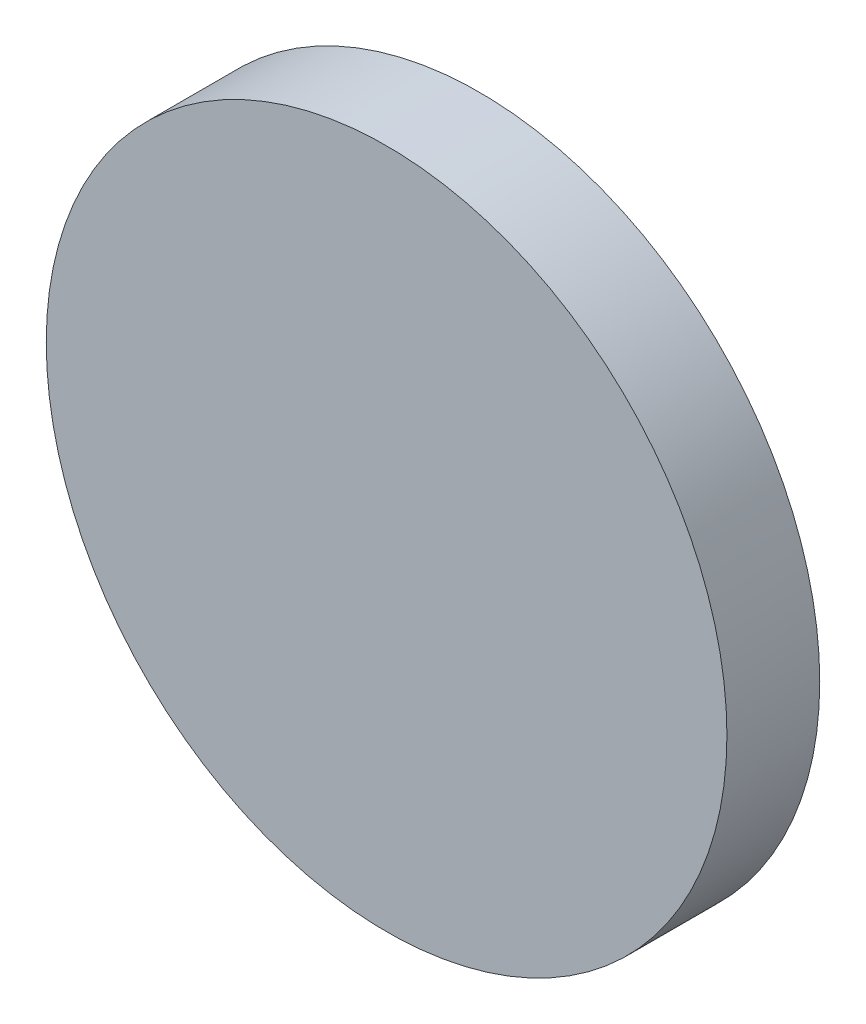
ISO-10303-21;
HEADER;
FILE_DESCRIPTION(('STEP AP214'),'2;1');
FILE_NAME('part.step','',(''),(''),'','','');
FILE_SCHEMA(('AUTOMOTIVE_DESIGN { 1 0 10303 214 1 1 1 1 }'));
ENDSEC;
DATA;
#1=APPLICATION_CONTEXT('core data for automotive mechanical design processes');
#2=APPLICATION_PROTOCOL_DEFINITION('international standard','automotive_design',2000,#1);
#3=PRODUCT_CONTEXT('',#1,'mechanical');
#4=PRODUCT('Part','Part','',(#3));
#5=PRODUCT_RELATED_PRODUCT_CATEGORY('part','',(#4));
#6=PRODUCT_DEFINITION_FORMATION('','',#4);
#7=PRODUCT_DEFINITION_CONTEXT('part definition',#1,'design');
#8=PRODUCT_DEFINITION('design','',#6,#7);
#9=PRODUCT_DEFINITION_SHAPE('','',#8);
#10=(LENGTH_UNIT() NAMED_UNIT(*) SI_UNIT(.MILLI.,.METRE.));
#11=(NAMED_UNIT(*) PLANE_ANGLE_UNIT() SI_UNIT($,.RADIAN.));
#12=(NAMED_UNIT(*) SI_UNIT($,.STERADIAN.) SOLID_ANGLE_UNIT());
#13=UNCERTAINTY_MEASURE_WITH_UNIT(LENGTH_MEASURE(1.E-05),#10,'distance_accuracy_value','');
#14=(GEOMETRIC_REPRESENTATION_CONTEXT(3) GLOBAL_UNCERTAINTY_ASSIGNED_CONTEXT((#13)) GLOBAL_UNIT_ASSIGNED_CONTEXT((#10,
#11,#12)) REPRESENTATION_CONTEXT('',''));
#15=CARTESIAN_POINT('',(0.,0.,0.));
#16=DIRECTION('',(0.,0.,1.));
#17=DIRECTION('',(1.,0.,0.));
#18=AXIS2_PLACEMENT_3D('',#15,#16,#17);
#19=CARTESIAN_POINT('',(0.,0.,3.));
#20=DIRECTION('',(0.,0.,-1.));
#21=DIRECTION('',(-1.,0.,0.));
#22=AXIS2_PLACEMENT_3D('',#19,#20,#21);
#23=CYLINDRICAL_SURFACE('',#22,11.);
#24=CARTESIAN_POINT('',(0.,0.,3.));
#25=DIRECTION('',(0.,0.,1.));
#26=DIRECTION('',(1.,0.,0.));
#27=AXIS2_PLACEMENT_3D('',#24,#25,#26);
#28=CIRCLE('',#27,11.);
#29=CARTESIAN_POINT('',(11.,0.,3.));
#30=VERTEX_POINT('',#29);
#31=EDGE_CURVE('E10',#30,#30,#28,.T.);
#32=ORIENTED_EDGE('',*,*,#31,.F.);
#33=EDGE_LOOP('',(#32));
#34=FACE_BOUND('',#33,.T.);
#35=CARTESIAN_POINT('',(0.,0.,0.));
#36=DIRECTION('',(0.,0.,1.));
#37=DIRECTION('',(1.,0.,0.));
#38=AXIS2_PLACEMENT_3D('',#35,#36,#37);
#39=CIRCLE('',#38,11.);
#40=CARTESIAN_POINT('',(11.,0.,0.));
#41=VERTEX_POINT('',#40);
#42=EDGE_CURVE('E35',#41,#41,#39,.T.);
#43=ORIENTED_EDGE('',*,*,#42,.T.);
#44=EDGE_LOOP('',(#43));
#45=FACE_BOUND('',#44,.T.);
#46=ADVANCED_FACE('F32',(#34,#45),#23,.T.);
#47=CARTESIAN_POINT('',(0.,0.,3.));
#48=DIRECTION('',(0.,0.,1.));
#49=DIRECTION('',(1.,0.,0.));
#50=AXIS2_PLACEMENT_3D('',#47,#48,#49);
#51=PLANE('',#50);
#52=ORIENTED_EDGE('',*,*,#31,.T.);
#53=EDGE_LOOP('',(#52));
#54=FACE_BOUND('',#53,.T.);
#55=ADVANCED_FACE('F47',(#54),#51,.T.);
#56=CARTESIAN_POINT('',(0.,0.,0.));
#57=DIRECTION('',(0.,0.,1.));
#58=DIRECTION('',(1.,0.,0.));
#59=AXIS2_PLACEMENT_3D('',#56,#57,#58);
#60=PLANE('',#59);
#61=ORIENTED_EDGE('',*,*,#42,.F.);
#62=EDGE_LOOP('',(#61));
#63=FACE_BOUND('',#62,.T.);
#64=ADVANCED_FACE('F45',(#63),#60,.F.);
#65=CLOSED_SHELL('',(#46,#55,#64));
#66=MANIFOLD_SOLID_BREP('B2',#65);
#67=ADVANCED_BREP_SHAPE_REPRESENTATION('',(#18,#66),#14);
#68=SHAPE_DEFINITION_REPRESENTATION(#9,#67);
ENDSEC;
END-ISO-10303-21;
